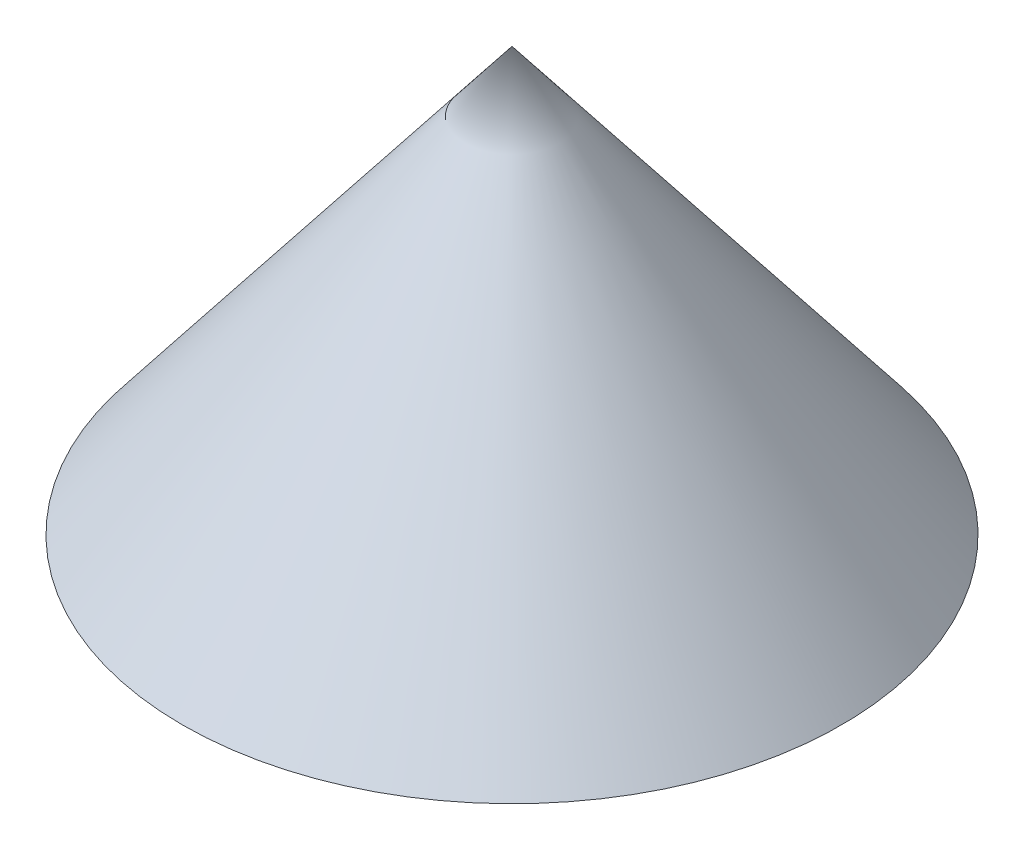
ISO-10303-21;
HEADER;
FILE_DESCRIPTION(('STEP AP214'),'2;1');
FILE_NAME('part.step','',(''),(''),'','','');
FILE_SCHEMA(('AUTOMOTIVE_DESIGN { 1 0 10303 214 1 1 1 1 }'));
ENDSEC;
DATA;
#1=APPLICATION_CONTEXT('core data for automotive mechanical design processes');
#2=APPLICATION_PROTOCOL_DEFINITION('international standard','automotive_design',2000,#1);
#3=PRODUCT_CONTEXT('',#1,'mechanical');
#4=PRODUCT('Part','Part','',(#3));
#5=PRODUCT_RELATED_PRODUCT_CATEGORY('part','',(#4));
#6=PRODUCT_DEFINITION_FORMATION('','',#4);
#7=PRODUCT_DEFINITION_CONTEXT('part definition',#1,'design');
#8=PRODUCT_DEFINITION('design','',#6,#7);
#9=PRODUCT_DEFINITION_SHAPE('','',#8);
#10=(LENGTH_UNIT() NAMED_UNIT(*) SI_UNIT(.MILLI.,.METRE.));
#11=(NAMED_UNIT(*) PLANE_ANGLE_UNIT() SI_UNIT($,.RADIAN.));
#12=(NAMED_UNIT(*) SI_UNIT($,.STERADIAN.) SOLID_ANGLE_UNIT());
#13=UNCERTAINTY_MEASURE_WITH_UNIT(LENGTH_MEASURE(1.E-05),#10,'distance_accuracy_value','');
#14=(GEOMETRIC_REPRESENTATION_CONTEXT(3) GLOBAL_UNCERTAINTY_ASSIGNED_CONTEXT((#13)) GLOBAL_UNIT_ASSIGNED_CONTEXT((#10,
#11,#12)) REPRESENTATION_CONTEXT('',''));
#15=CARTESIAN_POINT('',(0.,0.,0.));
#16=DIRECTION('',(0.,0.,1.));
#17=DIRECTION('',(1.,0.,0.));
#18=AXIS2_PLACEMENT_3D('',#15,#16,#17);
#19=CARTESIAN_POINT('',(-43.2978909180348,0.,0.));
#20=DIRECTION('',(0.,1.,0.));
#21=DIRECTION('',(0.,0.,1.));
#22=AXIS2_PLACEMENT_3D('',#19,#20,#21);
#23=PLANE('',#22);
#24=CARTESIAN_POINT('',(0.,0.,0.));
#25=DIRECTION('',(0.,-1.,0.));
#26=DIRECTION('',(0.,0.,-1.));
#27=AXIS2_PLACEMENT_3D('',#24,#25,#26);
#28=CIRCLE('',#27,43.2978909180348);
#29=CARTESIAN_POINT('',(0.,0.,-43.2978909180348));
#30=VERTEX_POINT('',#29);
#31=EDGE_CURVE('E11',#30,#30,#28,.T.);
#32=ORIENTED_EDGE('',*,*,#31,.T.);
#33=EDGE_LOOP('',(#32));
#34=FACE_BOUND('',#33,.T.);
#35=ADVANCED_FACE('F39',(#34),#23,.F.);
#36=CARTESIAN_POINT('',(0.,55.5656266781447,0.));
#37=DIRECTION('',(0.,-1.,0.));
#38=DIRECTION('',(0.,0.,-1.));
#39=AXIS2_PLACEMENT_3D('',#36,#37,#38);
#40=CONICAL_SURFACE('',#39,0.,0.661941641205508);
#41=ORIENTED_EDGE('',*,*,#31,.F.);
#42=EDGE_LOOP('',(#41));
#43=FACE_BOUND('',#42,.T.);
#44=CARTESIAN_POINT('',(0.,55.5656266781447,0.));
#45=VERTEX_POINT('',#44);
#46=VERTEX_LOOP('',#45);
#47=FACE_BOUND('',#46,.T.);
#48=ADVANCED_FACE('F47',(#43,#47),#40,.T.);
#49=CLOSED_SHELL('',(#35,#48));
#50=MANIFOLD_SOLID_BREP('B2',#49);
#51=ADVANCED_BREP_SHAPE_REPRESENTATION('',(#18,#50),#14);
#52=SHAPE_DEFINITION_REPRESENTATION(#9,#51);
ENDSEC;
END-ISO-10303-21;
